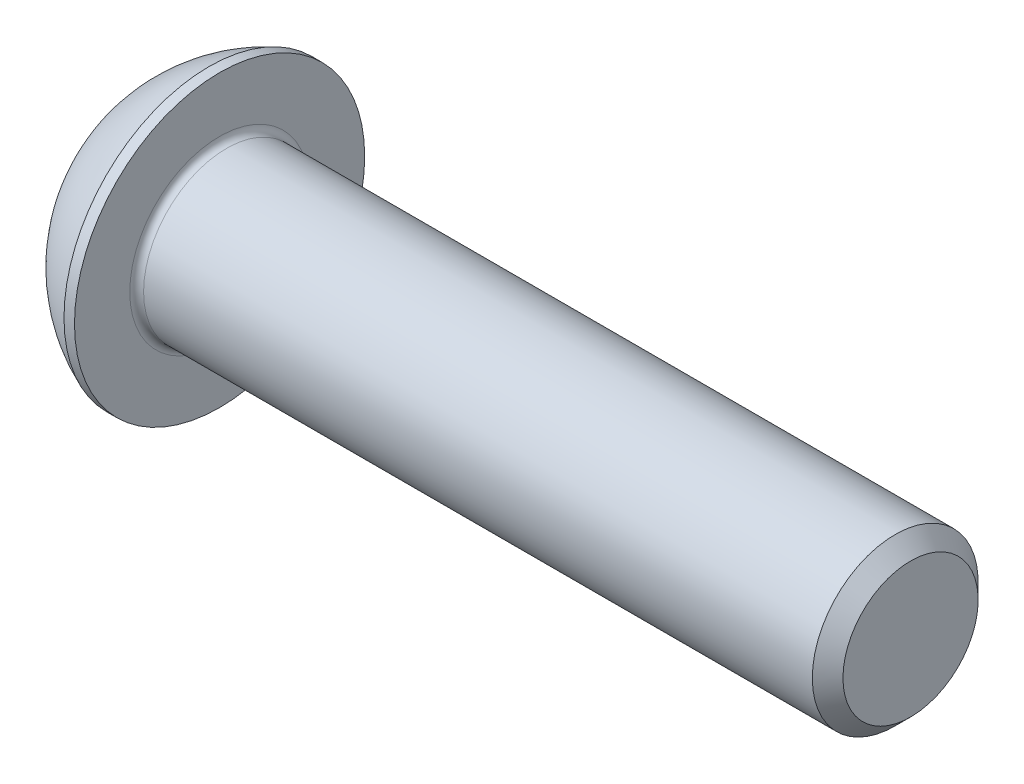
ISO-10303-21;
HEADER;
FILE_DESCRIPTION(('STEP AP214'),'2;1');
FILE_NAME('part.step','',(''),(''),'','','');
FILE_SCHEMA(('AUTOMOTIVE_DESIGN { 1 0 10303 214 1 1 1 1 }'));
ENDSEC;
DATA;
#1=APPLICATION_CONTEXT('core data for automotive mechanical design processes');
#2=APPLICATION_PROTOCOL_DEFINITION('international standard','automotive_design',2000,#1);
#3=PRODUCT_CONTEXT('',#1,'mechanical');
#4=PRODUCT('Part','Part','',(#3));
#5=PRODUCT_RELATED_PRODUCT_CATEGORY('part','',(#4));
#6=PRODUCT_DEFINITION_FORMATION('','',#4);
#7=PRODUCT_DEFINITION_CONTEXT('part definition',#1,'design');
#8=PRODUCT_DEFINITION('design','',#6,#7);
#9=PRODUCT_DEFINITION_SHAPE('','',#8);
#10=(LENGTH_UNIT() NAMED_UNIT(*) SI_UNIT(.MILLI.,.METRE.));
#11=(NAMED_UNIT(*) PLANE_ANGLE_UNIT() SI_UNIT($,.RADIAN.));
#12=(NAMED_UNIT(*) SI_UNIT($,.STERADIAN.) SOLID_ANGLE_UNIT());
#13=UNCERTAINTY_MEASURE_WITH_UNIT(LENGTH_MEASURE(1.E-05),#10,'distance_accuracy_value','');
#14=(GEOMETRIC_REPRESENTATION_CONTEXT(3) GLOBAL_UNCERTAINTY_ASSIGNED_CONTEXT((#13)) GLOBAL_UNIT_ASSIGNED_CONTEXT((#10,
#11,#12)) REPRESENTATION_CONTEXT('',''));
#15=CARTESIAN_POINT('',(0.,0.,0.));
#16=DIRECTION('',(0.,0.,1.));
#17=DIRECTION('',(1.,0.,0.));
#18=AXIS2_PLACEMENT_3D('',#15,#16,#17);
#19=CARTESIAN_POINT('',(0.,0.,0.));
#20=DIRECTION('',(-1.,0.,0.));
#21=DIRECTION('',(0.,0.,1.));
#22=AXIS2_PLACEMENT_3D('',#19,#20,#21);
#23=PLANE('',#22);
#24=CARTESIAN_POINT('',(0.,0.,0.));
#25=DIRECTION('',(-1.,0.,0.));
#26=DIRECTION('',(0.,0.,1.));
#27=AXIS2_PLACEMENT_3D('',#24,#25,#26);
#28=CIRCLE('',#27,2.625);
#29=CARTESIAN_POINT('',(0.,0.,2.625));
#30=VERTEX_POINT('',#29);
#31=EDGE_CURVE('E157',#30,#30,#28,.T.);
#32=ORIENTED_EDGE('',*,*,#31,.T.);
#33=EDGE_LOOP('',(#32));
#34=FACE_BOUND('',#33,.T.);
#35=DIRECTION('',(0.,-1.,0.));
#36=VECTOR('',#35,1.);
#37=CARTESIAN_POINT('',(0.,-1.15470053837925,2.));
#38=LINE('',#37,#36);
#39=CARTESIAN_POINT('',(0.,1.15470053837925,2.));
#40=VERTEX_POINT('',#39);
#41=CARTESIAN_POINT('',(0.,-1.15470053837925,2.));
#42=VERTEX_POINT('',#41);
#43=EDGE_CURVE('E52',#40,#42,#38,.T.);
#44=ORIENTED_EDGE('',*,*,#43,.T.);
#45=DIRECTION('',(0.,-0.5,-0.866025403784438));
#46=VECTOR('',#45,1.);
#47=CARTESIAN_POINT('',(0.,-2.3094010767585,0.));
#48=LINE('',#47,#46);
#49=CARTESIAN_POINT('',(0.,-2.3094010767585,0.));
#50=VERTEX_POINT('',#49);
#51=EDGE_CURVE('E277',#42,#50,#48,.T.);
#52=ORIENTED_EDGE('',*,*,#51,.T.);
#53=DIRECTION('',(0.,0.5,-0.866025403784438));
#54=VECTOR('',#53,1.);
#55=CARTESIAN_POINT('',(0.,-1.15470053837925,-2.));
#56=LINE('',#55,#54);
#57=CARTESIAN_POINT('',(0.,-1.15470053837925,-2.));
#58=VERTEX_POINT('',#57);
#59=EDGE_CURVE('E132',#50,#58,#56,.T.);
#60=ORIENTED_EDGE('',*,*,#59,.T.);
#61=DIRECTION('',(0.,1.,0.));
#62=VECTOR('',#61,1.);
#63=CARTESIAN_POINT('',(0.,1.15470053837925,-2.));
#64=LINE('',#63,#62);
#65=CARTESIAN_POINT('',(0.,1.15470053837925,-2.));
#66=VERTEX_POINT('',#65);
#67=EDGE_CURVE('E280',#58,#66,#64,.T.);
#68=ORIENTED_EDGE('',*,*,#67,.T.);
#69=DIRECTION('',(0.,0.5,0.866025403784439));
#70=VECTOR('',#69,1.);
#71=CARTESIAN_POINT('',(0.,2.3094010767585,0.));
#72=LINE('',#71,#70);
#73=CARTESIAN_POINT('',(0.,2.3094010767585,0.));
#74=VERTEX_POINT('',#73);
#75=EDGE_CURVE('E282',#66,#74,#72,.T.);
#76=ORIENTED_EDGE('',*,*,#75,.T.);
#77=DIRECTION('',(0.,-0.5,0.866025403784439));
#78=VECTOR('',#77,1.);
#79=CARTESIAN_POINT('',(0.,1.15470053837925,2.));
#80=LINE('',#79,#78);
#81=EDGE_CURVE('E284',#74,#40,#80,.T.);
#82=ORIENTED_EDGE('',*,*,#81,.T.);
#83=EDGE_LOOP('',(#44,#52,#60,#68,#76,#82));
#84=FACE_BOUND('',#83,.T.);
#85=ADVANCED_FACE('F37',(#34,#84),#23,.T.);
#86=CARTESIAN_POINT('',(4.99970462328768,0.,0.));
#87=DIRECTION('',(-1.,0.,0.));
#88=DIRECTION('',(0.,1.,0.));
#89=AXIS2_PLACEMENT_3D('',#86,#87,#88);
#90=SPHERICAL_SURFACE('',#89,5.64691697478581);
#91=CARTESIAN_POINT('',(2.92,0.,0.));
#92=DIRECTION('',(-1.,0.,0.));
#93=DIRECTION('',(0.,0.,1.));
#94=AXIS2_PLACEMENT_3D('',#91,#92,#93);
#95=CIRCLE('',#94,5.25);
#96=CARTESIAN_POINT('',(2.92,0.,5.25));
#97=VERTEX_POINT('',#96);
#98=EDGE_CURVE('E154',#97,#97,#95,.T.);
#99=ORIENTED_EDGE('',*,*,#98,.T.);
#100=EDGE_LOOP('',(#99));
#101=FACE_BOUND('',#100,.T.);
#102=ORIENTED_EDGE('',*,*,#31,.F.);
#103=EDGE_LOOP('',(#102));
#104=FACE_BOUND('',#103,.T.);
#105=ADVANCED_FACE('F178',(#101,#104),#90,.T.);
#106=CARTESIAN_POINT('',(0.,0.,0.));
#107=DIRECTION('',(-1.,0.,0.));
#108=DIRECTION('',(0.,0.,1.));
#109=AXIS2_PLACEMENT_3D('',#106,#107,#108);
#110=CYLINDRICAL_SURFACE('',#109,5.25);
#111=ORIENTED_EDGE('',*,*,#98,.F.);
#112=EDGE_LOOP('',(#111));
#113=FACE_BOUND('',#112,.T.);
#114=CARTESIAN_POINT('',(3.3,0.,0.));
#115=DIRECTION('',(-1.,0.,0.));
#116=DIRECTION('',(0.,0.,1.));
#117=AXIS2_PLACEMENT_3D('',#114,#115,#116);
#118=CIRCLE('',#117,5.25);
#119=CARTESIAN_POINT('',(3.3,0.,5.25));
#120=VERTEX_POINT('',#119);
#121=EDGE_CURVE('E151',#120,#120,#118,.T.);
#122=ORIENTED_EDGE('',*,*,#121,.T.);
#123=EDGE_LOOP('',(#122));
#124=FACE_BOUND('',#123,.T.);
#125=ADVANCED_FACE('F183',(#113,#124),#110,.T.);
#126=CARTESIAN_POINT('',(3.3,3.,0.));
#127=DIRECTION('',(-1.,0.,0.));
#128=DIRECTION('',(0.,0.,1.));
#129=AXIS2_PLACEMENT_3D('',#126,#127,#128);
#130=PLANE('',#129);
#131=CARTESIAN_POINT('',(3.3,0.,0.));
#132=DIRECTION('',(-1.,0.,0.));
#133=DIRECTION('',(0.,0.,1.));
#134=AXIS2_PLACEMENT_3D('',#131,#132,#133);
#135=CIRCLE('',#134,3.25);
#136=CARTESIAN_POINT('',(3.3,0.,3.25));
#137=VERTEX_POINT('',#136);
#138=EDGE_CURVE('E45',#137,#137,#135,.T.);
#139=ORIENTED_EDGE('',*,*,#138,.T.);
#140=EDGE_LOOP('',(#139));
#141=FACE_BOUND('',#140,.T.);
#142=ORIENTED_EDGE('',*,*,#121,.F.);
#143=EDGE_LOOP('',(#142));
#144=FACE_BOUND('',#143,.T.);
#145=ADVANCED_FACE('F162',(#141,#144),#130,.F.);
#146=CARTESIAN_POINT('',(0.,0.,0.));
#147=DIRECTION('',(-1.,0.,0.));
#148=DIRECTION('',(0.,0.,1.));
#149=AXIS2_PLACEMENT_3D('',#146,#147,#148);
#150=CYLINDRICAL_SURFACE('',#149,3.);
#151=CARTESIAN_POINT('',(3.55,0.,0.));
#152=DIRECTION('',(-1.,0.,0.));
#153=DIRECTION('',(0.,0.,1.));
#154=AXIS2_PLACEMENT_3D('',#151,#152,#153);
#155=CIRCLE('',#154,3.);
#156=CARTESIAN_POINT('',(3.55,0.,3.));
#157=VERTEX_POINT('',#156);
#158=EDGE_CURVE('E11',#157,#157,#155,.F.);
#159=ORIENTED_EDGE('',*,*,#158,.T.);
#160=EDGE_LOOP('',(#159));
#161=FACE_BOUND('',#160,.T.);
#162=CARTESIAN_POINT('',(27.7455,0.,0.));
#163=DIRECTION('',(-1.,0.,0.));
#164=DIRECTION('',(0.,0.,1.));
#165=AXIS2_PLACEMENT_3D('',#162,#163,#164);
#166=CIRCLE('',#165,3.);
#167=CARTESIAN_POINT('',(27.7455,0.,3.));
#168=VERTEX_POINT('',#167);
#169=EDGE_CURVE('E148',#168,#168,#166,.T.);
#170=ORIENTED_EDGE('',*,*,#169,.T.);
#171=EDGE_LOOP('',(#170));
#172=FACE_BOUND('',#171,.T.);
#173=ADVANCED_FACE('F192',(#161,#172),#150,.T.);
#174=CARTESIAN_POINT('',(28.3,0.,0.));
#175=DIRECTION('',(-1.,0.,0.));
#176=DIRECTION('',(0.,0.,1.));
#177=AXIS2_PLACEMENT_3D('',#174,#175,#176);
#178=CONICAL_SURFACE('',#177,2.4455,0.785398163397435);
#179=ORIENTED_EDGE('',*,*,#169,.F.);
#180=EDGE_LOOP('',(#179));
#181=FACE_BOUND('',#180,.T.);
#182=CARTESIAN_POINT('',(28.3,0.,0.));
#183=DIRECTION('',(-1.,0.,0.));
#184=DIRECTION('',(0.,0.,1.));
#185=AXIS2_PLACEMENT_3D('',#182,#183,#184);
#186=CIRCLE('',#185,2.4455);
#187=CARTESIAN_POINT('',(28.3,0.,2.4455));
#188=VERTEX_POINT('',#187);
#189=EDGE_CURVE('E144',#188,#188,#186,.T.);
#190=ORIENTED_EDGE('',*,*,#189,.T.);
#191=EDGE_LOOP('',(#190));
#192=FACE_BOUND('',#191,.T.);
#193=ADVANCED_FACE('F173',(#181,#192),#178,.T.);
#194=CARTESIAN_POINT('',(28.3,0.,0.));
#195=DIRECTION('',(-1.,0.,0.));
#196=DIRECTION('',(0.,0.,1.));
#197=AXIS2_PLACEMENT_3D('',#194,#195,#196);
#198=PLANE('',#197);
#199=ORIENTED_EDGE('',*,*,#189,.F.);
#200=EDGE_LOOP('',(#199));
#201=FACE_BOUND('',#200,.T.);
#202=ADVANCED_FACE('F166',(#201),#198,.F.);
#203=CARTESIAN_POINT('',(3.55,0.,0.));
#204=DIRECTION('',(-1.,0.,0.));
#205=DIRECTION('',(0.,0.,1.));
#206=AXIS2_PLACEMENT_3D('',#203,#204,#205);
#207=TOROIDAL_SURFACE('',#206,3.25,0.25);
#208=ORIENTED_EDGE('',*,*,#158,.F.);
#209=EDGE_LOOP('',(#208));
#210=FACE_BOUND('',#209,.T.);
#211=ORIENTED_EDGE('',*,*,#138,.F.);
#212=EDGE_LOOP('',(#211));
#213=FACE_BOUND('',#212,.T.);
#214=ADVANCED_FACE('F39',(#210,#213),#207,.F.);
#215=CARTESIAN_POINT('',(2.08,-2.3094010767585,0.));
#216=DIRECTION('',(0.,0.866025403784438,-0.500000000000001));
#217=DIRECTION('',(0.,0.500000000000001,0.866025403784438));
#218=AXIS2_PLACEMENT_3D('',#215,#216,#217);
#219=PLANE('',#218);
#220=DIRECTION('',(0.,-0.5,-0.866025403784438));
#221=VECTOR('',#220,1.);
#222=CARTESIAN_POINT('',(2.08,-2.3094010767585,0.));
#223=LINE('',#222,#221);
#224=CARTESIAN_POINT('',(2.08,-1.15470053837925,2.));
#225=VERTEX_POINT('',#224);
#226=CARTESIAN_POINT('',(2.08,-1.73205080756888,1.));
#227=VERTEX_POINT('',#226);
#228=EDGE_CURVE('E118',#225,#227,#223,.T.);
#229=ORIENTED_EDGE('',*,*,#228,.T.);
#230=CARTESIAN_POINT('',(2.08,-2.3094010767585,0.));
#231=VERTEX_POINT('',#230);
#232=EDGE_CURVE('E113',#227,#231,#223,.T.);
#233=ORIENTED_EDGE('',*,*,#232,.T.);
#234=DIRECTION('',(-1.,0.,0.));
#235=VECTOR('',#234,1.);
#236=CARTESIAN_POINT('',(2.08,-2.3094010767585,0.));
#237=LINE('',#236,#235);
#238=EDGE_CURVE('E115',#231,#50,#237,.T.);
#239=ORIENTED_EDGE('',*,*,#238,.T.);
#240=ORIENTED_EDGE('',*,*,#51,.F.);
#241=DIRECTION('',(-1.,0.,0.));
#242=VECTOR('',#241,1.);
#243=CARTESIAN_POINT('',(2.08,-1.15470053837925,2.));
#244=LINE('',#243,#242);
#245=EDGE_CURVE('E273',#225,#42,#244,.T.);
#246=ORIENTED_EDGE('',*,*,#245,.F.);
#247=EDGE_LOOP('',(#229,#233,#239,#240,#246));
#248=FACE_BOUND('',#247,.T.);
#249=ADVANCED_FACE('F114',(#248),#219,.T.);
#250=CARTESIAN_POINT('',(2.08,-1.15470053837925,-2.));
#251=DIRECTION('',(0.,0.866025403784438,0.5));
#252=DIRECTION('',(0.,-0.5,0.866025403784438));
#253=AXIS2_PLACEMENT_3D('',#250,#251,#252);
#254=PLANE('',#253);
#255=DIRECTION('',(0.,0.5,-0.866025403784438));
#256=VECTOR('',#255,1.);
#257=CARTESIAN_POINT('',(2.08,-1.15470053837925,-2.));
#258=LINE('',#257,#256);
#259=CARTESIAN_POINT('',(2.08,-1.73205080756888,-1.));
#260=VERTEX_POINT('',#259);
#261=EDGE_CURVE('E60',#231,#260,#258,.T.);
#262=ORIENTED_EDGE('',*,*,#261,.T.);
#263=CARTESIAN_POINT('',(2.08,-1.15470053837925,-2.));
#264=VERTEX_POINT('',#263);
#265=EDGE_CURVE('E127',#260,#264,#258,.T.);
#266=ORIENTED_EDGE('',*,*,#265,.T.);
#267=DIRECTION('',(-1.,0.,0.));
#268=VECTOR('',#267,1.);
#269=CARTESIAN_POINT('',(2.08,-1.15470053837925,-2.));
#270=LINE('',#269,#268);
#271=EDGE_CURVE('E134',#264,#58,#270,.T.);
#272=ORIENTED_EDGE('',*,*,#271,.T.);
#273=ORIENTED_EDGE('',*,*,#59,.F.);
#274=ORIENTED_EDGE('',*,*,#238,.F.);
#275=EDGE_LOOP('',(#262,#266,#272,#273,#274));
#276=FACE_BOUND('',#275,.T.);
#277=ADVANCED_FACE('F130',(#276),#254,.T.);
#278=CARTESIAN_POINT('',(2.08,1.15470053837925,-2.));
#279=DIRECTION('',(0.,0.,1.));
#280=DIRECTION('',(1.,0.,0.));
#281=AXIS2_PLACEMENT_3D('',#278,#279,#280);
#282=PLANE('',#281);
#283=DIRECTION('',(0.,1.,0.));
#284=VECTOR('',#283,1.);
#285=CARTESIAN_POINT('',(2.08,1.15470053837925,-2.));
#286=LINE('',#285,#284);
#287=CARTESIAN_POINT('',(2.08,0.,-2.));
#288=VERTEX_POINT('',#287);
#289=EDGE_CURVE('E254',#264,#288,#286,.T.);
#290=ORIENTED_EDGE('',*,*,#289,.T.);
#291=CARTESIAN_POINT('',(2.08,1.15470053837925,-2.));
#292=VERTEX_POINT('',#291);
#293=EDGE_CURVE('E126',#288,#292,#286,.T.);
#294=ORIENTED_EDGE('',*,*,#293,.T.);
#295=DIRECTION('',(-1.,0.,0.));
#296=VECTOR('',#295,1.);
#297=CARTESIAN_POINT('',(2.08,1.15470053837925,-2.));
#298=LINE('',#297,#296);
#299=EDGE_CURVE('E139',#292,#66,#298,.T.);
#300=ORIENTED_EDGE('',*,*,#299,.T.);
#301=ORIENTED_EDGE('',*,*,#67,.F.);
#302=ORIENTED_EDGE('',*,*,#271,.F.);
#303=EDGE_LOOP('',(#290,#294,#300,#301,#302));
#304=FACE_BOUND('',#303,.T.);
#305=ADVANCED_FACE('F206',(#304),#282,.T.);
#306=CARTESIAN_POINT('',(2.08,2.3094010767585,0.));
#307=DIRECTION('',(0.,-0.866025403784439,0.5));
#308=DIRECTION('',(0.,-0.5,-0.866025403784439));
#309=AXIS2_PLACEMENT_3D('',#306,#307,#308);
#310=PLANE('',#309);
#311=DIRECTION('',(0.,0.5,0.866025403784439));
#312=VECTOR('',#311,1.);
#313=CARTESIAN_POINT('',(2.08,2.3094010767585,0.));
#314=LINE('',#313,#312);
#315=CARTESIAN_POINT('',(2.08,1.73205080756888,-0.999999999999999));
#316=VERTEX_POINT('',#315);
#317=EDGE_CURVE('E243',#292,#316,#314,.T.);
#318=ORIENTED_EDGE('',*,*,#317,.T.);
#319=CARTESIAN_POINT('',(2.08,2.3094010767585,0.));
#320=VERTEX_POINT('',#319);
#321=EDGE_CURVE('E248',#316,#320,#314,.T.);
#322=ORIENTED_EDGE('',*,*,#321,.T.);
#323=DIRECTION('',(-1.,0.,0.));
#324=VECTOR('',#323,1.);
#325=CARTESIAN_POINT('',(2.08,2.3094010767585,0.));
#326=LINE('',#325,#324);
#327=EDGE_CURVE('E288',#320,#74,#326,.T.);
#328=ORIENTED_EDGE('',*,*,#327,.T.);
#329=ORIENTED_EDGE('',*,*,#75,.F.);
#330=ORIENTED_EDGE('',*,*,#299,.F.);
#331=EDGE_LOOP('',(#318,#322,#328,#329,#330));
#332=FACE_BOUND('',#331,.T.);
#333=ADVANCED_FACE('F209',(#332),#310,.T.);
#334=CARTESIAN_POINT('',(2.08,1.15470053837925,2.));
#335=DIRECTION('',(0.,-0.866025403784439,-0.5));
#336=DIRECTION('',(0.,0.5,-0.866025403784439));
#337=AXIS2_PLACEMENT_3D('',#334,#335,#336);
#338=PLANE('',#337);
#339=DIRECTION('',(0.,-0.5,0.866025403784439));
#340=VECTOR('',#339,1.);
#341=CARTESIAN_POINT('',(2.08,1.15470053837925,2.));
#342=LINE('',#341,#340);
#343=CARTESIAN_POINT('',(2.08,1.73205080756888,0.999999999999999));
#344=VERTEX_POINT('',#343);
#345=EDGE_CURVE('E251',#320,#344,#342,.T.);
#346=ORIENTED_EDGE('',*,*,#345,.T.);
#347=CARTESIAN_POINT('',(2.08,1.15470053837925,2.));
#348=VERTEX_POINT('',#347);
#349=EDGE_CURVE('E259',#344,#348,#342,.T.);
#350=ORIENTED_EDGE('',*,*,#349,.T.);
#351=DIRECTION('',(-1.,0.,0.));
#352=VECTOR('',#351,1.);
#353=CARTESIAN_POINT('',(2.08,1.15470053837925,2.));
#354=LINE('',#353,#352);
#355=EDGE_CURVE('E272',#348,#40,#354,.T.);
#356=ORIENTED_EDGE('',*,*,#355,.T.);
#357=ORIENTED_EDGE('',*,*,#81,.F.);
#358=ORIENTED_EDGE('',*,*,#327,.F.);
#359=EDGE_LOOP('',(#346,#350,#356,#357,#358));
#360=FACE_BOUND('',#359,.T.);
#361=ADVANCED_FACE('F213',(#360),#338,.T.);
#362=CARTESIAN_POINT('',(2.08,-1.15470053837925,2.));
#363=DIRECTION('',(0.,0.,-1.));
#364=DIRECTION('',(-1.,0.,0.));
#365=AXIS2_PLACEMENT_3D('',#362,#363,#364);
#366=PLANE('',#365);
#367=DIRECTION('',(0.,-1.,0.));
#368=VECTOR('',#367,1.);
#369=CARTESIAN_POINT('',(2.08,-1.15470053837925,2.));
#370=LINE('',#369,#368);
#371=CARTESIAN_POINT('',(2.08,0.,2.));
#372=VERTEX_POINT('',#371);
#373=EDGE_CURVE('E265',#348,#372,#370,.T.);
#374=ORIENTED_EDGE('',*,*,#373,.T.);
#375=EDGE_CURVE('E267',#372,#225,#370,.T.);
#376=ORIENTED_EDGE('',*,*,#375,.T.);
#377=ORIENTED_EDGE('',*,*,#245,.T.);
#378=ORIENTED_EDGE('',*,*,#43,.F.);
#379=ORIENTED_EDGE('',*,*,#355,.F.);
#380=EDGE_LOOP('',(#374,#376,#377,#378,#379));
#381=FACE_BOUND('',#380,.T.);
#382=ADVANCED_FACE('F217',(#381),#366,.T.);
#383=CARTESIAN_POINT('',(2.08,-2.3094010767585,0.));
#384=DIRECTION('',(1.,0.,0.));
#385=DIRECTION('',(0.,0.,-1.));
#386=AXIS2_PLACEMENT_3D('',#383,#384,#385);
#387=PLANE('',#386);
#388=CARTESIAN_POINT('',(2.08,0.,0.));
#389=DIRECTION('',(-1.,0.,0.));
#390=DIRECTION('',(0.,0.,1.));
#391=AXIS2_PLACEMENT_3D('',#388,#389,#390);
#392=CIRCLE('',#391,2.);
#393=EDGE_CURVE('E240',#316,#288,#392,.T.);
#394=ORIENTED_EDGE('',*,*,#393,.F.);
#395=ORIENTED_EDGE('',*,*,#317,.F.);
#396=ORIENTED_EDGE('',*,*,#293,.F.);
#397=EDGE_LOOP('',(#394,#395,#396));
#398=FACE_BOUND('',#397,.T.);
#399=ADVANCED_FACE('F221',(#398),#387,.F.);
#400=EDGE_CURVE('E145',#344,#316,#392,.T.);
#401=ORIENTED_EDGE('',*,*,#400,.F.);
#402=ORIENTED_EDGE('',*,*,#345,.F.);
#403=ORIENTED_EDGE('',*,*,#321,.F.);
#404=EDGE_LOOP('',(#401,#402,#403));
#405=FACE_BOUND('',#404,.T.);
#406=ADVANCED_FACE('F230',(#405),#387,.F.);
#407=EDGE_CURVE('E138',#372,#344,#392,.T.);
#408=ORIENTED_EDGE('',*,*,#407,.F.);
#409=ORIENTED_EDGE('',*,*,#373,.F.);
#410=ORIENTED_EDGE('',*,*,#349,.F.);
#411=EDGE_LOOP('',(#408,#409,#410));
#412=FACE_BOUND('',#411,.T.);
#413=ADVANCED_FACE('F235',(#412),#387,.F.);
#414=EDGE_CURVE('E133',#227,#372,#392,.T.);
#415=ORIENTED_EDGE('',*,*,#414,.F.);
#416=ORIENTED_EDGE('',*,*,#228,.F.);
#417=ORIENTED_EDGE('',*,*,#375,.F.);
#418=EDGE_LOOP('',(#415,#416,#417));
#419=FACE_BOUND('',#418,.T.);
#420=ADVANCED_FACE('F228',(#419),#387,.F.);
#421=EDGE_CURVE('E124',#260,#227,#392,.T.);
#422=ORIENTED_EDGE('',*,*,#421,.F.);
#423=ORIENTED_EDGE('',*,*,#261,.F.);
#424=ORIENTED_EDGE('',*,*,#232,.F.);
#425=EDGE_LOOP('',(#422,#423,#424));
#426=FACE_BOUND('',#425,.T.);
#427=ADVANCED_FACE('F123',(#426),#387,.F.);
#428=EDGE_CURVE('E246',#288,#260,#392,.T.);
#429=ORIENTED_EDGE('',*,*,#428,.F.);
#430=ORIENTED_EDGE('',*,*,#289,.F.);
#431=ORIENTED_EDGE('',*,*,#265,.F.);
#432=EDGE_LOOP('',(#429,#430,#431));
#433=FACE_BOUND('',#432,.T.);
#434=ADVANCED_FACE('F201',(#433),#387,.F.);
#435=CARTESIAN_POINT('',(3.23470053837926,0.,0.));
#436=DIRECTION('',(-1.,0.,0.));
#437=DIRECTION('',(0.,0.,1.));
#438=AXIS2_PLACEMENT_3D('',#435,#436,#437);
#439=CONICAL_SURFACE('',#438,0.,1.04719755119659);
#440=ORIENTED_EDGE('',*,*,#407,.T.);
#441=ORIENTED_EDGE('',*,*,#400,.T.);
#442=ORIENTED_EDGE('',*,*,#393,.T.);
#443=ORIENTED_EDGE('',*,*,#428,.T.);
#444=ORIENTED_EDGE('',*,*,#421,.T.);
#445=ORIENTED_EDGE('',*,*,#414,.T.);
#446=EDGE_LOOP('',(#440,#441,#442,#443,#444,#445));
#447=FACE_BOUND('',#446,.T.);
#448=CARTESIAN_POINT('',(3.23470053837926,0.,0.));
#449=VERTEX_POINT('',#448);
#450=VERTEX_LOOP('',#449);
#451=FACE_BOUND('',#450,.T.);
#452=ADVANCED_FACE('F199',(#447,#451),#439,.F.);
#453=CLOSED_SHELL('',(#85,#105,#125,#145,#173,#193,#202,#214,#249,#277,#305,#333,#361,#382,#399,
#406,#413,#420,#427,#434,#452));
#454=MANIFOLD_SOLID_BREP('B2',#453);
#455=ADVANCED_BREP_SHAPE_REPRESENTATION('',(#18,#454),#14);
#456=SHAPE_DEFINITION_REPRESENTATION(#9,#455);
ENDSEC;
END-ISO-10303-21;
